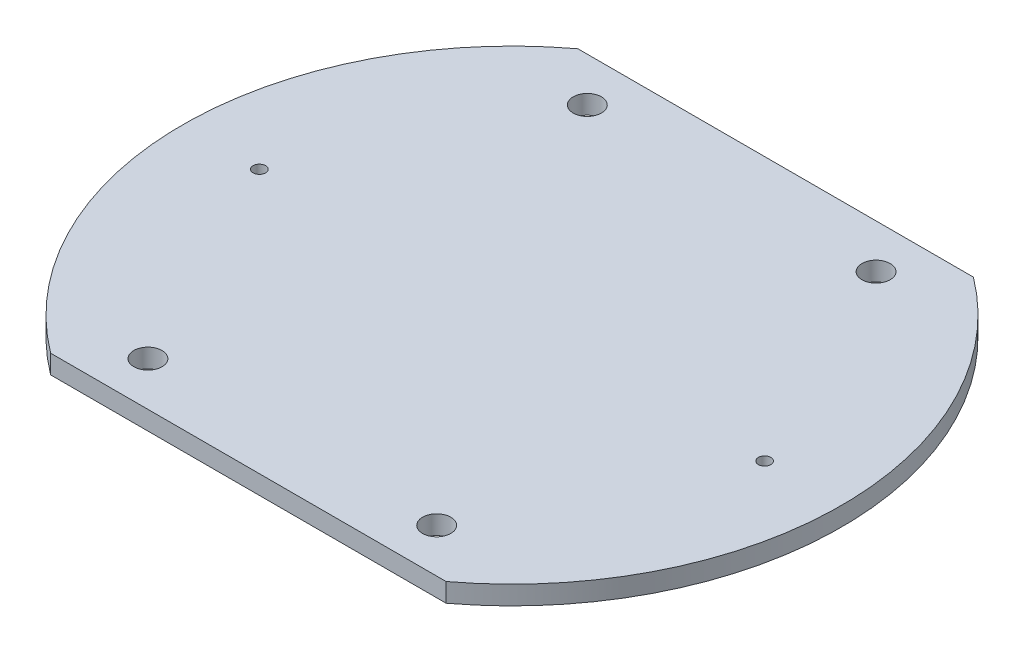
ISO-10303-21;
HEADER;
FILE_DESCRIPTION(('STEP AP214'),'2;1');
FILE_NAME('part.step','',(''),(''),'','','');
FILE_SCHEMA(('AUTOMOTIVE_DESIGN { 1 0 10303 214 1 1 1 1 }'));
ENDSEC;
DATA;
#1=APPLICATION_CONTEXT('core data for automotive mechanical design processes');
#2=APPLICATION_PROTOCOL_DEFINITION('international standard','automotive_design',2000,#1);
#3=PRODUCT_CONTEXT('',#1,'mechanical');
#4=PRODUCT('Part','Part','',(#3));
#5=PRODUCT_RELATED_PRODUCT_CATEGORY('part','',(#4));
#6=PRODUCT_DEFINITION_FORMATION('','',#4);
#7=PRODUCT_DEFINITION_CONTEXT('part definition',#1,'design');
#8=PRODUCT_DEFINITION('design','',#6,#7);
#9=PRODUCT_DEFINITION_SHAPE('','',#8);
#10=(LENGTH_UNIT() NAMED_UNIT(*) SI_UNIT(.MILLI.,.METRE.));
#11=(NAMED_UNIT(*) PLANE_ANGLE_UNIT() SI_UNIT($,.RADIAN.));
#12=(NAMED_UNIT(*) SI_UNIT($,.STERADIAN.) SOLID_ANGLE_UNIT());
#13=UNCERTAINTY_MEASURE_WITH_UNIT(LENGTH_MEASURE(1.E-05),#10,'distance_accuracy_value','');
#14=(GEOMETRIC_REPRESENTATION_CONTEXT(3) GLOBAL_UNCERTAINTY_ASSIGNED_CONTEXT((#13)) GLOBAL_UNIT_ASSIGNED_CONTEXT((#10,
#11,#12)) REPRESENTATION_CONTEXT('',''));
#15=CARTESIAN_POINT('',(0.,0.,0.));
#16=DIRECTION('',(0.,0.,1.));
#17=DIRECTION('',(1.,0.,0.));
#18=AXIS2_PLACEMENT_3D('',#15,#16,#17);
#19=CARTESIAN_POINT('',(0.,3.,0.));
#20=DIRECTION('',(0.,-1.,0.));
#21=DIRECTION('',(0.,0.,-1.));
#22=AXIS2_PLACEMENT_3D('',#19,#20,#21);
#23=CYLINDRICAL_SURFACE('',#22,52.5);
#24=CARTESIAN_POINT('',(0.,3.,0.));
#25=DIRECTION('',(0.,1.,0.));
#26=DIRECTION('',(0.,0.,1.));
#27=AXIS2_PLACEMENT_3D('',#24,#25,#26);
#28=CIRCLE('',#27,52.5);
#29=CARTESIAN_POINT('',(31.5,3.,42.));
#30=VERTEX_POINT('',#29);
#31=CARTESIAN_POINT('',(31.5,3.,-42.));
#32=VERTEX_POINT('',#31);
#33=EDGE_CURVE('E41',#30,#32,#28,.T.);
#34=ORIENTED_EDGE('',*,*,#33,.F.);
#35=DIRECTION('',(0.,1.,0.));
#36=VECTOR('',#35,1.);
#37=CARTESIAN_POINT('',(31.5,0.,42.));
#38=LINE('',#37,#36);
#39=CARTESIAN_POINT('',(31.5,0.,42.));
#40=VERTEX_POINT('',#39);
#41=EDGE_CURVE('E80',#40,#30,#38,.T.);
#42=ORIENTED_EDGE('',*,*,#41,.F.);
#43=CARTESIAN_POINT('',(0.,0.,0.));
#44=DIRECTION('',(0.,1.,0.));
#45=DIRECTION('',(0.,0.,1.));
#46=AXIS2_PLACEMENT_3D('',#43,#44,#45);
#47=CIRCLE('',#46,52.5);
#48=CARTESIAN_POINT('',(31.5,0.,-42.));
#49=VERTEX_POINT('',#48);
#50=EDGE_CURVE('E89',#40,#49,#47,.T.);
#51=ORIENTED_EDGE('',*,*,#50,.T.);
#52=DIRECTION('',(0.,1.,0.));
#53=VECTOR('',#52,1.);
#54=CARTESIAN_POINT('',(31.5,0.,-42.));
#55=LINE('',#54,#53);
#56=EDGE_CURVE('E127',#49,#32,#55,.T.);
#57=ORIENTED_EDGE('',*,*,#56,.T.);
#58=EDGE_LOOP('',(#34,#42,#51,#57));
#59=FACE_BOUND('',#58,.T.);
#60=ADVANCED_FACE('F32',(#59),#23,.T.);
#61=CARTESIAN_POINT('',(0.,3.,0.));
#62=DIRECTION('',(0.,1.,0.));
#63=DIRECTION('',(0.,0.,1.));
#64=AXIS2_PLACEMENT_3D('',#61,#62,#63);
#65=PLANE('',#64);
#66=CARTESIAN_POINT('',(-23.,3.,-35.));
#67=DIRECTION('',(0.,1.,0.));
#68=DIRECTION('',(0.,0.,1.));
#69=AXIS2_PLACEMENT_3D('',#66,#67,#68);
#70=CIRCLE('',#69,2.2479);
#71=CARTESIAN_POINT('',(-23.,3.,-32.7521));
#72=VERTEX_POINT('',#71);
#73=EDGE_CURVE('E116',#72,#72,#70,.T.);
#74=ORIENTED_EDGE('',*,*,#73,.F.);
#75=EDGE_LOOP('',(#74));
#76=FACE_BOUND('',#75,.T.);
#77=CARTESIAN_POINT('',(23.,3.,-35.));
#78=DIRECTION('',(0.,1.,0.));
#79=DIRECTION('',(0.,0.,1.));
#80=AXIS2_PLACEMENT_3D('',#77,#78,#79);
#81=CIRCLE('',#80,2.2479);
#82=CARTESIAN_POINT('',(23.,3.,-32.7521));
#83=VERTEX_POINT('',#82);
#84=EDGE_CURVE('E106',#83,#83,#81,.T.);
#85=ORIENTED_EDGE('',*,*,#84,.F.);
#86=EDGE_LOOP('',(#85));
#87=FACE_BOUND('',#86,.T.);
#88=CARTESIAN_POINT('',(23.,3.,35.));
#89=DIRECTION('',(0.,1.,0.));
#90=DIRECTION('',(0.,0.,1.));
#91=AXIS2_PLACEMENT_3D('',#88,#89,#90);
#92=CIRCLE('',#91,2.2479);
#93=CARTESIAN_POINT('',(23.,3.,37.2479));
#94=VERTEX_POINT('',#93);
#95=EDGE_CURVE('E103',#94,#94,#92,.T.);
#96=ORIENTED_EDGE('',*,*,#95,.F.);
#97=EDGE_LOOP('',(#96));
#98=FACE_BOUND('',#97,.T.);
#99=CARTESIAN_POINT('',(-23.,3.,35.));
#100=DIRECTION('',(0.,1.,0.));
#101=DIRECTION('',(0.,0.,1.));
#102=AXIS2_PLACEMENT_3D('',#99,#100,#101);
#103=CIRCLE('',#102,2.2479);
#104=CARTESIAN_POINT('',(-23.,3.,37.2479));
#105=VERTEX_POINT('',#104);
#106=EDGE_CURVE('E100',#105,#105,#103,.T.);
#107=ORIENTED_EDGE('',*,*,#106,.F.);
#108=EDGE_LOOP('',(#107));
#109=FACE_BOUND('',#108,.T.);
#110=DIRECTION('',(-1.,0.,0.));
#111=VECTOR('',#110,1.);
#112=CARTESIAN_POINT('',(-31.5,3.,42.));
#113=LINE('',#112,#111);
#114=CARTESIAN_POINT('',(-31.5,3.,42.));
#115=VERTEX_POINT('',#114);
#116=EDGE_CURVE('E49',#30,#115,#113,.T.);
#117=ORIENTED_EDGE('',*,*,#116,.F.);
#118=ORIENTED_EDGE('',*,*,#33,.T.);
#119=DIRECTION('',(1.,0.,0.));
#120=VECTOR('',#119,1.);
#121=CARTESIAN_POINT('',(-31.5,3.,-42.));
#122=LINE('',#121,#120);
#123=CARTESIAN_POINT('',(-31.5,3.,-42.));
#124=VERTEX_POINT('',#123);
#125=EDGE_CURVE('E122',#124,#32,#122,.T.);
#126=ORIENTED_EDGE('',*,*,#125,.F.);
#127=EDGE_CURVE('E11',#124,#115,#28,.T.);
#128=ORIENTED_EDGE('',*,*,#127,.T.);
#129=EDGE_LOOP('',(#117,#118,#126,#128));
#130=FACE_BOUND('',#129,.T.);
#131=CARTESIAN_POINT('',(40.25,3.,0.));
#132=DIRECTION('',(0.,1.,0.));
#133=DIRECTION('',(0.,0.,-1.));
#134=AXIS2_PLACEMENT_3D('',#131,#132,#133);
#135=CIRCLE('',#134,0.999999999999998);
#136=CARTESIAN_POINT('',(40.25,3.,-0.999999999999993));
#137=VERTEX_POINT('',#136);
#138=EDGE_CURVE('E132',#137,#137,#135,.T.);
#139=ORIENTED_EDGE('',*,*,#138,.F.);
#140=EDGE_LOOP('',(#139));
#141=FACE_BOUND('',#140,.T.);
#142=CARTESIAN_POINT('',(-40.25,3.,0.));
#143=DIRECTION('',(0.,1.,0.));
#144=DIRECTION('',(0.,0.,1.));
#145=AXIS2_PLACEMENT_3D('',#142,#143,#144);
#146=CIRCLE('',#145,0.999999999999998);
#147=CARTESIAN_POINT('',(-40.25,3.,1.));
#148=VERTEX_POINT('',#147);
#149=EDGE_CURVE('E94',#148,#148,#146,.T.);
#150=ORIENTED_EDGE('',*,*,#149,.F.);
#151=EDGE_LOOP('',(#150));
#152=FACE_BOUND('',#151,.T.);
#153=ADVANCED_FACE('F156',(#76,#87,#98,#109,#130,#141,#152),#65,.T.);
#154=CARTESIAN_POINT('',(0.,0.,0.));
#155=DIRECTION('',(0.,1.,0.));
#156=DIRECTION('',(0.,0.,1.));
#157=AXIS2_PLACEMENT_3D('',#154,#155,#156);
#158=PLANE('',#157);
#159=CARTESIAN_POINT('',(-23.,0.,-35.));
#160=DIRECTION('',(0.,1.,0.));
#161=DIRECTION('',(0.,0.,1.));
#162=AXIS2_PLACEMENT_3D('',#159,#160,#161);
#163=CIRCLE('',#162,2.2479);
#164=CARTESIAN_POINT('',(-23.,0.,-32.7521));
#165=VERTEX_POINT('',#164);
#166=EDGE_CURVE('E36',#165,#165,#163,.T.);
#167=ORIENTED_EDGE('',*,*,#166,.T.);
#168=EDGE_LOOP('',(#167));
#169=FACE_BOUND('',#168,.T.);
#170=CARTESIAN_POINT('',(23.,0.,-35.));
#171=DIRECTION('',(0.,1.,0.));
#172=DIRECTION('',(0.,0.,1.));
#173=AXIS2_PLACEMENT_3D('',#170,#171,#172);
#174=CIRCLE('',#173,2.2479);
#175=CARTESIAN_POINT('',(23.,0.,-32.7521));
#176=VERTEX_POINT('',#175);
#177=EDGE_CURVE('E104',#176,#176,#174,.T.);
#178=ORIENTED_EDGE('',*,*,#177,.T.);
#179=EDGE_LOOP('',(#178));
#180=FACE_BOUND('',#179,.T.);
#181=CARTESIAN_POINT('',(23.,0.,35.));
#182=DIRECTION('',(0.,1.,0.));
#183=DIRECTION('',(0.,0.,1.));
#184=AXIS2_PLACEMENT_3D('',#181,#182,#183);
#185=CIRCLE('',#184,2.2479);
#186=CARTESIAN_POINT('',(23.,0.,37.2479));
#187=VERTEX_POINT('',#186);
#188=EDGE_CURVE('E101',#187,#187,#185,.T.);
#189=ORIENTED_EDGE('',*,*,#188,.T.);
#190=EDGE_LOOP('',(#189));
#191=FACE_BOUND('',#190,.T.);
#192=CARTESIAN_POINT('',(-23.,0.,35.));
#193=DIRECTION('',(0.,1.,0.));
#194=DIRECTION('',(0.,0.,1.));
#195=AXIS2_PLACEMENT_3D('',#192,#193,#194);
#196=CIRCLE('',#195,2.2479);
#197=CARTESIAN_POINT('',(-23.,0.,37.2479));
#198=VERTEX_POINT('',#197);
#199=EDGE_CURVE('E97',#198,#198,#196,.T.);
#200=ORIENTED_EDGE('',*,*,#199,.T.);
#201=EDGE_LOOP('',(#200));
#202=FACE_BOUND('',#201,.T.);
#203=CARTESIAN_POINT('',(40.25,0.,0.));
#204=DIRECTION('',(0.,1.,0.));
#205=DIRECTION('',(0.,0.,-1.));
#206=AXIS2_PLACEMENT_3D('',#203,#204,#205);
#207=CIRCLE('',#206,0.999999999999998);
#208=CARTESIAN_POINT('',(40.25,0.,-0.999999999999993));
#209=VERTEX_POINT('',#208);
#210=EDGE_CURVE('E130',#209,#209,#207,.T.);
#211=ORIENTED_EDGE('',*,*,#210,.T.);
#212=EDGE_LOOP('',(#211));
#213=FACE_BOUND('',#212,.T.);
#214=ORIENTED_EDGE('',*,*,#50,.F.);
#215=DIRECTION('',(-1.,0.,0.));
#216=VECTOR('',#215,1.);
#217=CARTESIAN_POINT('',(-31.5,0.,42.));
#218=LINE('',#217,#216);
#219=CARTESIAN_POINT('',(-31.5,0.,42.));
#220=VERTEX_POINT('',#219);
#221=EDGE_CURVE('E75',#40,#220,#218,.T.);
#222=ORIENTED_EDGE('',*,*,#221,.T.);
#223=CARTESIAN_POINT('',(-31.5,0.,-42.));
#224=VERTEX_POINT('',#223);
#225=EDGE_CURVE('E88',#224,#220,#47,.T.);
#226=ORIENTED_EDGE('',*,*,#225,.F.);
#227=DIRECTION('',(1.,0.,0.));
#228=VECTOR('',#227,1.);
#229=CARTESIAN_POINT('',(-31.5,0.,-42.));
#230=LINE('',#229,#228);
#231=EDGE_CURVE('E124',#224,#49,#230,.T.);
#232=ORIENTED_EDGE('',*,*,#231,.T.);
#233=EDGE_LOOP('',(#214,#222,#226,#232));
#234=FACE_BOUND('',#233,.T.);
#235=CARTESIAN_POINT('',(-40.25,0.,0.));
#236=DIRECTION('',(0.,1.,0.));
#237=DIRECTION('',(0.,0.,1.));
#238=AXIS2_PLACEMENT_3D('',#235,#236,#237);
#239=CIRCLE('',#238,0.999999999999998);
#240=CARTESIAN_POINT('',(-40.25,0.,1.));
#241=VERTEX_POINT('',#240);
#242=EDGE_CURVE('E135',#241,#241,#239,.T.);
#243=ORIENTED_EDGE('',*,*,#242,.T.);
#244=EDGE_LOOP('',(#243));
#245=FACE_BOUND('',#244,.T.);
#246=ADVANCED_FACE('F85',(#169,#180,#191,#202,#213,#234,#245),#158,.F.);
#247=ORIENTED_EDGE('',*,*,#225,.T.);
#248=DIRECTION('',(0.,1.,0.));
#249=VECTOR('',#248,1.);
#250=CARTESIAN_POINT('',(-31.5,0.,42.));
#251=LINE('',#250,#249);
#252=EDGE_CURVE('E72',#220,#115,#251,.T.);
#253=ORIENTED_EDGE('',*,*,#252,.T.);
#254=ORIENTED_EDGE('',*,*,#127,.F.);
#255=DIRECTION('',(0.,1.,0.));
#256=VECTOR('',#255,1.);
#257=CARTESIAN_POINT('',(-31.5,0.,-42.));
#258=LINE('',#257,#256);
#259=EDGE_CURVE('E92',#224,#124,#258,.T.);
#260=ORIENTED_EDGE('',*,*,#259,.F.);
#261=EDGE_LOOP('',(#247,#253,#254,#260));
#262=FACE_BOUND('',#261,.T.);
#263=ADVANCED_FACE('F34',(#262),#23,.T.);
#264=CARTESIAN_POINT('',(-40.25,3.,0.));
#265=DIRECTION('',(0.,-1.,0.));
#266=DIRECTION('',(0.,0.,-1.));
#267=AXIS2_PLACEMENT_3D('',#264,#265,#266);
#268=CYLINDRICAL_SURFACE('',#267,0.999999999999998);
#269=ORIENTED_EDGE('',*,*,#149,.T.);
#270=EDGE_LOOP('',(#269));
#271=FACE_BOUND('',#270,.T.);
#272=ORIENTED_EDGE('',*,*,#242,.F.);
#273=EDGE_LOOP('',(#272));
#274=FACE_BOUND('',#273,.T.);
#275=ADVANCED_FACE('F142',(#271,#274),#268,.F.);
#276=CARTESIAN_POINT('',(40.25,3.,0.));
#277=DIRECTION('',(0.,-1.,0.));
#278=DIRECTION('',(0.,0.,-1.));
#279=AXIS2_PLACEMENT_3D('',#276,#277,#278);
#280=CYLINDRICAL_SURFACE('',#279,0.999999999999998);
#281=ORIENTED_EDGE('',*,*,#138,.T.);
#282=EDGE_LOOP('',(#281));
#283=FACE_BOUND('',#282,.T.);
#284=ORIENTED_EDGE('',*,*,#210,.F.);
#285=EDGE_LOOP('',(#284));
#286=FACE_BOUND('',#285,.T.);
#287=ADVANCED_FACE('F144',(#283,#286),#280,.F.);
#288=CARTESIAN_POINT('',(-31.5,0.,-42.));
#289=DIRECTION('',(0.,0.,1.));
#290=DIRECTION('',(1.,0.,0.));
#291=AXIS2_PLACEMENT_3D('',#288,#289,#290);
#292=PLANE('',#291);
#293=ORIENTED_EDGE('',*,*,#125,.T.);
#294=ORIENTED_EDGE('',*,*,#56,.F.);
#295=ORIENTED_EDGE('',*,*,#231,.F.);
#296=ORIENTED_EDGE('',*,*,#259,.T.);
#297=EDGE_LOOP('',(#293,#294,#295,#296));
#298=FACE_BOUND('',#297,.T.);
#299=ADVANCED_FACE('F151',(#298),#292,.F.);
#300=CARTESIAN_POINT('',(-31.5,0.,42.));
#301=DIRECTION('',(0.,0.,-1.));
#302=DIRECTION('',(-1.,0.,0.));
#303=AXIS2_PLACEMENT_3D('',#300,#301,#302);
#304=PLANE('',#303);
#305=ORIENTED_EDGE('',*,*,#116,.T.);
#306=ORIENTED_EDGE('',*,*,#252,.F.);
#307=ORIENTED_EDGE('',*,*,#221,.F.);
#308=ORIENTED_EDGE('',*,*,#41,.T.);
#309=EDGE_LOOP('',(#305,#306,#307,#308));
#310=FACE_BOUND('',#309,.T.);
#311=ADVANCED_FACE('F74',(#310),#304,.F.);
#312=CARTESIAN_POINT('',(-23.,3.,35.));
#313=DIRECTION('',(0.,1.,0.));
#314=DIRECTION('',(0.,0.,1.));
#315=AXIS2_PLACEMENT_3D('',#312,#313,#314);
#316=CYLINDRICAL_SURFACE('',#315,2.2479);
#317=ORIENTED_EDGE('',*,*,#106,.T.);
#318=EDGE_LOOP('',(#317));
#319=FACE_BOUND('',#318,.T.);
#320=ORIENTED_EDGE('',*,*,#199,.F.);
#321=EDGE_LOOP('',(#320));
#322=FACE_BOUND('',#321,.T.);
#323=ADVANCED_FACE('F181',(#319,#322),#316,.F.);
#324=CARTESIAN_POINT('',(23.,3.,35.));
#325=DIRECTION('',(0.,1.,0.));
#326=DIRECTION('',(0.,0.,1.));
#327=AXIS2_PLACEMENT_3D('',#324,#325,#326);
#328=CYLINDRICAL_SURFACE('',#327,2.2479);
#329=ORIENTED_EDGE('',*,*,#95,.T.);
#330=EDGE_LOOP('',(#329));
#331=FACE_BOUND('',#330,.T.);
#332=ORIENTED_EDGE('',*,*,#188,.F.);
#333=EDGE_LOOP('',(#332));
#334=FACE_BOUND('',#333,.T.);
#335=ADVANCED_FACE('F183',(#331,#334),#328,.F.);
#336=CARTESIAN_POINT('',(23.,3.,-35.));
#337=DIRECTION('',(0.,1.,0.));
#338=DIRECTION('',(0.,0.,1.));
#339=AXIS2_PLACEMENT_3D('',#336,#337,#338);
#340=CYLINDRICAL_SURFACE('',#339,2.2479);
#341=ORIENTED_EDGE('',*,*,#84,.T.);
#342=EDGE_LOOP('',(#341));
#343=FACE_BOUND('',#342,.T.);
#344=ORIENTED_EDGE('',*,*,#177,.F.);
#345=EDGE_LOOP('',(#344));
#346=FACE_BOUND('',#345,.T.);
#347=ADVANCED_FACE('F190',(#343,#346),#340,.F.);
#348=CARTESIAN_POINT('',(-23.,3.,-35.));
#349=DIRECTION('',(0.,1.,0.));
#350=DIRECTION('',(0.,0.,1.));
#351=AXIS2_PLACEMENT_3D('',#348,#349,#350);
#352=CYLINDRICAL_SURFACE('',#351,2.2479);
#353=ORIENTED_EDGE('',*,*,#73,.T.);
#354=EDGE_LOOP('',(#353));
#355=FACE_BOUND('',#354,.T.);
#356=ORIENTED_EDGE('',*,*,#166,.F.);
#357=EDGE_LOOP('',(#356));
#358=FACE_BOUND('',#357,.T.);
#359=ADVANCED_FACE('F236',(#355,#358),#352,.F.);
#360=CLOSED_SHELL('',(#60,#153,#246,#263,#275,#287,#299,#311,#323,#335,#347,#359));
#361=MANIFOLD_SOLID_BREP('B2',#360);
#362=ADVANCED_BREP_SHAPE_REPRESENTATION('',(#18,#361),#14);
#363=SHAPE_DEFINITION_REPRESENTATION(#9,#362);
ENDSEC;
END-ISO-10303-21;
